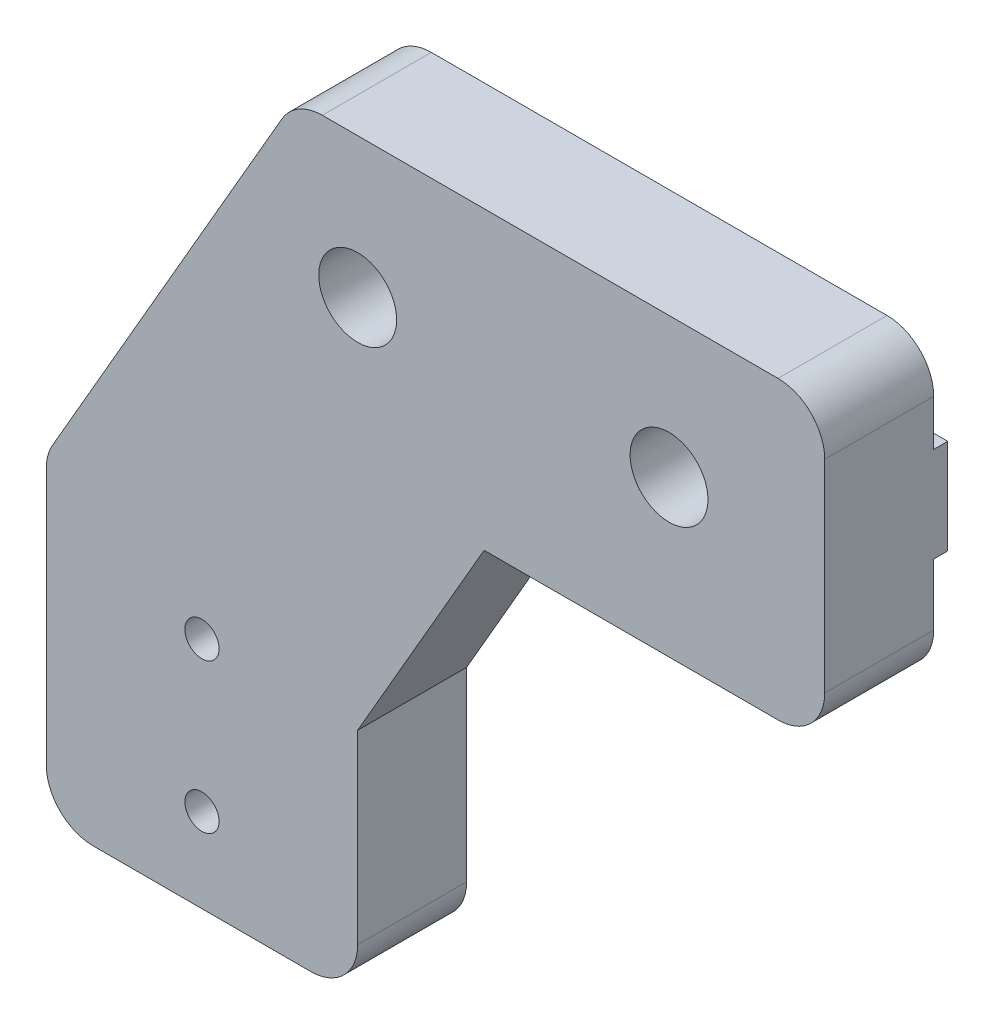
ISO-10303-21;
HEADER;
FILE_DESCRIPTION(('STEP AP214'),'2;1');
FILE_NAME('part.step','',(''),(''),'','','');
FILE_SCHEMA(('AUTOMOTIVE_DESIGN { 1 0 10303 214 1 1 1 1 }'));
ENDSEC;
DATA;
#1=APPLICATION_CONTEXT('core data for automotive mechanical design processes');
#2=APPLICATION_PROTOCOL_DEFINITION('international standard','automotive_design',2000,#1);
#3=PRODUCT_CONTEXT('',#1,'mechanical');
#4=PRODUCT('Part','Part','',(#3));
#5=PRODUCT_RELATED_PRODUCT_CATEGORY('part','',(#4));
#6=PRODUCT_DEFINITION_FORMATION('','',#4);
#7=PRODUCT_DEFINITION_CONTEXT('part definition',#1,'design');
#8=PRODUCT_DEFINITION('design','',#6,#7);
#9=PRODUCT_DEFINITION_SHAPE('','',#8);
#10=(LENGTH_UNIT() NAMED_UNIT(*) SI_UNIT(.MILLI.,.METRE.));
#11=(NAMED_UNIT(*) PLANE_ANGLE_UNIT() SI_UNIT($,.RADIAN.));
#12=(NAMED_UNIT(*) SI_UNIT($,.STERADIAN.) SOLID_ANGLE_UNIT());
#13=UNCERTAINTY_MEASURE_WITH_UNIT(LENGTH_MEASURE(1.E-05),#10,'distance_accuracy_value','');
#14=(GEOMETRIC_REPRESENTATION_CONTEXT(3) GLOBAL_UNCERTAINTY_ASSIGNED_CONTEXT((#13)) GLOBAL_UNIT_ASSIGNED_CONTEXT((#10,
#11,#12)) REPRESENTATION_CONTEXT('',''));
#15=CARTESIAN_POINT('',(0.,0.,0.));
#16=DIRECTION('',(0.,0.,1.));
#17=DIRECTION('',(1.,0.,0.));
#18=AXIS2_PLACEMENT_3D('',#15,#16,#17);
#19=CARTESIAN_POINT('',(3.,19.4833395016044,0.));
#20=DIRECTION('',(0.,0.,-1.));
#21=DIRECTION('',(-1.,0.,0.));
#22=AXIS2_PLACEMENT_3D('',#19,#20,#21);
#23=PLANE('',#22);
#24=CARTESIAN_POINT('',(10.,5.4,0.));
#25=DIRECTION('',(0.,0.,1.));
#26=DIRECTION('',(1.,0.,0.));
#27=AXIS2_PLACEMENT_3D('',#24,#25,#26);
#28=CIRCLE('',#27,1.1);
#29=CARTESIAN_POINT('',(11.1,5.4,0.));
#30=VERTEX_POINT('',#29);
#31=EDGE_CURVE('E197',#30,#30,#28,.T.);
#32=ORIENTED_EDGE('',*,*,#31,.T.);
#33=EDGE_LOOP('',(#32));
#34=FACE_BOUND('',#33,.T.);
#35=CARTESIAN_POINT('',(10.,15.,0.));
#36=DIRECTION('',(0.,0.,1.));
#37=DIRECTION('',(1.,0.,0.));
#38=AXIS2_PLACEMENT_3D('',#35,#36,#37);
#39=CIRCLE('',#38,1.1);
#40=CARTESIAN_POINT('',(11.1,15.,0.));
#41=VERTEX_POINT('',#40);
#42=EDGE_CURVE('E198',#41,#41,#39,.T.);
#43=ORIENTED_EDGE('',*,*,#42,.T.);
#44=EDGE_LOOP('',(#43));
#45=FACE_BOUND('',#44,.T.);
#46=DIRECTION('',(-0.499999999999998,-0.86602540378444,0.));
#47=VECTOR('',#46,1.);
#48=CARTESIAN_POINT('',(15.1339745962156,46.5,0.));
#49=LINE('',#48,#47);
#50=CARTESIAN_POINT('',(9.04292925626505,35.95,0.));
#51=VERTEX_POINT('',#50);
#52=CARTESIAN_POINT('',(0.401923788646674,20.9833395016044,0.));
#53=VERTEX_POINT('',#52);
#54=EDGE_CURVE('E54',#51,#53,#49,.T.);
#55=ORIENTED_EDGE('',*,*,#54,.F.);
#56=DIRECTION('',(1.,0.,0.));
#57=VECTOR('',#56,1.);
#58=CARTESIAN_POINT('',(4.16086702878034,35.95,0.));
#59=LINE('',#58,#57);
#60=CARTESIAN_POINT('',(50.,35.95,0.));
#61=VERTEX_POINT('',#60);
#62=EDGE_CURVE('E49',#51,#61,#59,.T.);
#63=ORIENTED_EDGE('',*,*,#62,.T.);
#64=DIRECTION('',(0.,1.,0.));
#65=VECTOR('',#64,1.);
#66=CARTESIAN_POINT('',(50.,32.,0.));
#67=LINE('',#66,#65);
#68=CARTESIAN_POINT('',(50.,32.,0.));
#69=VERTEX_POINT('',#68);
#70=EDGE_CURVE('E181',#69,#61,#67,.T.);
#71=ORIENTED_EDGE('',*,*,#70,.F.);
#72=CARTESIAN_POINT('',(47.,32.,0.));
#73=DIRECTION('',(0.,0.,1.));
#74=DIRECTION('',(1.,0.,0.));
#75=AXIS2_PLACEMENT_3D('',#72,#73,#74);
#76=CIRCLE('',#75,3.);
#77=CARTESIAN_POINT('',(47.,29.,0.));
#78=VERTEX_POINT('',#77);
#79=EDGE_CURVE('E260',#78,#69,#76,.T.);
#80=ORIENTED_EDGE('',*,*,#79,.F.);
#81=DIRECTION('',(1.,0.,0.));
#82=VECTOR('',#81,1.);
#83=CARTESIAN_POINT('',(28.1243556529822,29.,0.));
#84=LINE('',#83,#82);
#85=CARTESIAN_POINT('',(28.1243556529822,29.,0.));
#86=VERTEX_POINT('',#85);
#87=EDGE_CURVE('E258',#86,#78,#84,.T.);
#88=ORIENTED_EDGE('',*,*,#87,.F.);
#89=DIRECTION('',(0.499999999999998,0.86602540378444,0.));
#90=VECTOR('',#89,1.);
#91=CARTESIAN_POINT('',(20.,14.9282032302754,0.));
#92=LINE('',#91,#90);
#93=CARTESIAN_POINT('',(20.,14.9282032302754,0.));
#94=VERTEX_POINT('',#93);
#95=EDGE_CURVE('E256',#94,#86,#92,.T.);
#96=ORIENTED_EDGE('',*,*,#95,.F.);
#97=DIRECTION('',(0.,1.,0.));
#98=VECTOR('',#97,1.);
#99=CARTESIAN_POINT('',(20.,3.00000000000002,0.));
#100=LINE('',#99,#98);
#101=CARTESIAN_POINT('',(20.,3.00000000000002,0.));
#102=VERTEX_POINT('',#101);
#103=EDGE_CURVE('E254',#102,#94,#100,.T.);
#104=ORIENTED_EDGE('',*,*,#103,.F.);
#105=CARTESIAN_POINT('',(17.,3.,0.));
#106=DIRECTION('',(0.,0.,1.));
#107=DIRECTION('',(1.,0.,0.));
#108=AXIS2_PLACEMENT_3D('',#105,#106,#107);
#109=CIRCLE('',#108,3.);
#110=CARTESIAN_POINT('',(17.,0.,0.));
#111=VERTEX_POINT('',#110);
#112=EDGE_CURVE('E252',#111,#102,#109,.T.);
#113=ORIENTED_EDGE('',*,*,#112,.F.);
#114=DIRECTION('',(1.,0.,0.));
#115=VECTOR('',#114,1.);
#116=CARTESIAN_POINT('',(3.00000000000002,0.,0.));
#117=LINE('',#116,#115);
#118=CARTESIAN_POINT('',(3.00000000000002,0.,0.));
#119=VERTEX_POINT('',#118);
#120=EDGE_CURVE('E250',#119,#111,#117,.T.);
#121=ORIENTED_EDGE('',*,*,#120,.F.);
#122=CARTESIAN_POINT('',(3.,3.,0.));
#123=DIRECTION('',(0.,0.,1.));
#124=DIRECTION('',(1.,0.,0.));
#125=AXIS2_PLACEMENT_3D('',#122,#123,#124);
#126=CIRCLE('',#125,3.);
#127=CARTESIAN_POINT('',(0.,3.00000000000002,0.));
#128=VERTEX_POINT('',#127);
#129=EDGE_CURVE('E248',#128,#119,#126,.T.);
#130=ORIENTED_EDGE('',*,*,#129,.F.);
#131=DIRECTION('',(0.,-1.,0.));
#132=VECTOR('',#131,1.);
#133=CARTESIAN_POINT('',(0.,19.4833395016044,0.));
#134=LINE('',#133,#132);
#135=CARTESIAN_POINT('',(0.,19.4833395016044,0.));
#136=VERTEX_POINT('',#135);
#137=EDGE_CURVE('E246',#136,#128,#134,.T.);
#138=ORIENTED_EDGE('',*,*,#137,.F.);
#139=CARTESIAN_POINT('',(3.,19.4833395016044,0.));
#140=DIRECTION('',(0.,0.,1.));
#141=DIRECTION('',(-1.,0.,0.));
#142=AXIS2_PLACEMENT_3D('',#139,#140,#141);
#143=CIRCLE('',#142,3.);
#144=EDGE_CURVE('E212',#53,#136,#143,.T.);
#145=ORIENTED_EDGE('',*,*,#144,.F.);
#146=EDGE_LOOP('',(#55,#63,#71,#80,#88,#96,#104,#113,#121,#130,#138,#145));
#147=FACE_BOUND('',#146,.T.);
#148=ADVANCED_FACE('F32',(#34,#45,#147),#23,.T.);
#149=CARTESIAN_POINT('',(3.,19.4833395016044,7.));
#150=DIRECTION('',(0.,0.,-1.));
#151=DIRECTION('',(-1.,0.,0.));
#152=AXIS2_PLACEMENT_3D('',#149,#150,#151);
#153=PLANE('',#152);
#154=CARTESIAN_POINT('',(10.,5.4,7.));
#155=DIRECTION('',(0.,0.,1.));
#156=DIRECTION('',(1.,0.,0.));
#157=AXIS2_PLACEMENT_3D('',#154,#155,#156);
#158=CIRCLE('',#157,1.1);
#159=CARTESIAN_POINT('',(11.1,5.4,7.));
#160=VERTEX_POINT('',#159);
#161=EDGE_CURVE('E201',#160,#160,#158,.T.);
#162=ORIENTED_EDGE('',*,*,#161,.F.);
#163=EDGE_LOOP('',(#162));
#164=FACE_BOUND('',#163,.T.);
#165=CARTESIAN_POINT('',(20.,39.,7.));
#166=DIRECTION('',(0.,0.,1.));
#167=DIRECTION('',(1.,0.,0.));
#168=AXIS2_PLACEMENT_3D('',#165,#166,#167);
#169=CIRCLE('',#168,2.5);
#170=CARTESIAN_POINT('',(22.5,39.,7.));
#171=VERTEX_POINT('',#170);
#172=EDGE_CURVE('E209',#171,#171,#169,.T.);
#173=ORIENTED_EDGE('',*,*,#172,.F.);
#174=EDGE_LOOP('',(#173));
#175=FACE_BOUND('',#174,.T.);
#176=CARTESIAN_POINT('',(3.,19.4833395016044,7.));
#177=DIRECTION('',(0.,0.,1.));
#178=DIRECTION('',(-1.,0.,0.));
#179=AXIS2_PLACEMENT_3D('',#176,#177,#178);
#180=CIRCLE('',#179,3.);
#181=CARTESIAN_POINT('',(0.401923788646674,20.9833395016044,7.));
#182=VERTEX_POINT('',#181);
#183=CARTESIAN_POINT('',(0.,19.4833395016044,7.));
#184=VERTEX_POINT('',#183);
#185=EDGE_CURVE('E213',#182,#184,#180,.T.);
#186=ORIENTED_EDGE('',*,*,#185,.T.);
#187=DIRECTION('',(0.,-1.,0.));
#188=VECTOR('',#187,1.);
#189=CARTESIAN_POINT('',(0.,19.4833395016044,7.));
#190=LINE('',#189,#188);
#191=CARTESIAN_POINT('',(0.,3.00000000000002,7.));
#192=VERTEX_POINT('',#191);
#193=EDGE_CURVE('E216',#184,#192,#190,.T.);
#194=ORIENTED_EDGE('',*,*,#193,.T.);
#195=CARTESIAN_POINT('',(3.,3.,7.));
#196=DIRECTION('',(0.,0.,1.));
#197=DIRECTION('',(1.,0.,0.));
#198=AXIS2_PLACEMENT_3D('',#195,#196,#197);
#199=CIRCLE('',#198,3.);
#200=CARTESIAN_POINT('',(3.00000000000002,0.,7.));
#201=VERTEX_POINT('',#200);
#202=EDGE_CURVE('E219',#192,#201,#199,.T.);
#203=ORIENTED_EDGE('',*,*,#202,.T.);
#204=DIRECTION('',(1.,0.,0.));
#205=VECTOR('',#204,1.);
#206=CARTESIAN_POINT('',(3.00000000000002,0.,7.));
#207=LINE('',#206,#205);
#208=CARTESIAN_POINT('',(17.,0.,7.));
#209=VERTEX_POINT('',#208);
#210=EDGE_CURVE('E221',#201,#209,#207,.T.);
#211=ORIENTED_EDGE('',*,*,#210,.T.);
#212=CARTESIAN_POINT('',(17.,3.,7.));
#213=DIRECTION('',(0.,0.,1.));
#214=DIRECTION('',(1.,0.,0.));
#215=AXIS2_PLACEMENT_3D('',#212,#213,#214);
#216=CIRCLE('',#215,3.);
#217=CARTESIAN_POINT('',(20.,3.00000000000002,7.));
#218=VERTEX_POINT('',#217);
#219=EDGE_CURVE('E223',#209,#218,#216,.T.);
#220=ORIENTED_EDGE('',*,*,#219,.T.);
#221=DIRECTION('',(0.,1.,0.));
#222=VECTOR('',#221,1.);
#223=CARTESIAN_POINT('',(20.,3.00000000000002,7.));
#224=LINE('',#223,#222);
#225=CARTESIAN_POINT('',(20.,14.9282032302754,7.));
#226=VERTEX_POINT('',#225);
#227=EDGE_CURVE('E225',#218,#226,#224,.T.);
#228=ORIENTED_EDGE('',*,*,#227,.T.);
#229=DIRECTION('',(0.499999999999998,0.86602540378444,0.));
#230=VECTOR('',#229,1.);
#231=CARTESIAN_POINT('',(20.,14.9282032302754,7.));
#232=LINE('',#231,#230);
#233=CARTESIAN_POINT('',(28.1243556529822,29.,7.));
#234=VERTEX_POINT('',#233);
#235=EDGE_CURVE('E227',#226,#234,#232,.T.);
#236=ORIENTED_EDGE('',*,*,#235,.T.);
#237=DIRECTION('',(1.,0.,0.));
#238=VECTOR('',#237,1.);
#239=CARTESIAN_POINT('',(28.1243556529822,29.,7.));
#240=LINE('',#239,#238);
#241=CARTESIAN_POINT('',(47.,29.,7.));
#242=VERTEX_POINT('',#241);
#243=EDGE_CURVE('E229',#234,#242,#240,.T.);
#244=ORIENTED_EDGE('',*,*,#243,.T.);
#245=CARTESIAN_POINT('',(47.,32.,7.));
#246=DIRECTION('',(0.,0.,1.));
#247=DIRECTION('',(1.,0.,0.));
#248=AXIS2_PLACEMENT_3D('',#245,#246,#247);
#249=CIRCLE('',#248,3.);
#250=CARTESIAN_POINT('',(50.,32.,7.));
#251=VERTEX_POINT('',#250);
#252=EDGE_CURVE('E231',#242,#251,#249,.T.);
#253=ORIENTED_EDGE('',*,*,#252,.T.);
#254=DIRECTION('',(0.,1.,0.));
#255=VECTOR('',#254,1.);
#256=CARTESIAN_POINT('',(50.,32.,7.));
#257=LINE('',#256,#255);
#258=CARTESIAN_POINT('',(50.,45.,7.));
#259=VERTEX_POINT('',#258);
#260=EDGE_CURVE('E233',#251,#259,#257,.T.);
#261=ORIENTED_EDGE('',*,*,#260,.T.);
#262=CARTESIAN_POINT('',(47.,45.,7.));
#263=DIRECTION('',(0.,0.,1.));
#264=DIRECTION('',(1.,0.,0.));
#265=AXIS2_PLACEMENT_3D('',#262,#263,#264);
#266=CIRCLE('',#265,3.);
#267=CARTESIAN_POINT('',(47.,48.,7.));
#268=VERTEX_POINT('',#267);
#269=EDGE_CURVE('E235',#259,#268,#266,.T.);
#270=ORIENTED_EDGE('',*,*,#269,.T.);
#271=DIRECTION('',(-1.,0.,0.));
#272=VECTOR('',#271,1.);
#273=CARTESIAN_POINT('',(47.,48.,7.));
#274=LINE('',#273,#272);
#275=CARTESIAN_POINT('',(17.7320508075689,48.,7.));
#276=VERTEX_POINT('',#275);
#277=EDGE_CURVE('E237',#268,#276,#274,.T.);
#278=ORIENTED_EDGE('',*,*,#277,.T.);
#279=CARTESIAN_POINT('',(17.7320508075689,45.,7.));
#280=DIRECTION('',(0.,0.,1.));
#281=DIRECTION('',(-1.,0.,0.));
#282=AXIS2_PLACEMENT_3D('',#279,#280,#281);
#283=CIRCLE('',#282,3.);
#284=CARTESIAN_POINT('',(15.1339745962156,46.5,7.));
#285=VERTEX_POINT('',#284);
#286=EDGE_CURVE('E239',#276,#285,#283,.T.);
#287=ORIENTED_EDGE('',*,*,#286,.T.);
#288=DIRECTION('',(-0.499999999999998,-0.86602540378444,0.));
#289=VECTOR('',#288,1.);
#290=CARTESIAN_POINT('',(15.1339745962156,46.5,7.));
#291=LINE('',#290,#289);
#292=EDGE_CURVE('E241',#285,#182,#291,.T.);
#293=ORIENTED_EDGE('',*,*,#292,.T.);
#294=EDGE_LOOP('',(#186,#194,#203,#211,#220,#228,#236,#244,#253,#261,#270,#278,#287,#293));
#295=FACE_BOUND('',#294,.T.);
#296=CARTESIAN_POINT('',(40.,39.,7.));
#297=DIRECTION('',(0.,0.,1.));
#298=DIRECTION('',(1.,0.,0.));
#299=AXIS2_PLACEMENT_3D('',#296,#297,#298);
#300=CIRCLE('',#299,2.5);
#301=CARTESIAN_POINT('',(42.5,39.,7.));
#302=VERTEX_POINT('',#301);
#303=EDGE_CURVE('E204',#302,#302,#300,.T.);
#304=ORIENTED_EDGE('',*,*,#303,.F.);
#305=EDGE_LOOP('',(#304));
#306=FACE_BOUND('',#305,.T.);
#307=CARTESIAN_POINT('',(10.,15.,7.));
#308=DIRECTION('',(0.,0.,1.));
#309=DIRECTION('',(1.,0.,0.));
#310=AXIS2_PLACEMENT_3D('',#307,#308,#309);
#311=CIRCLE('',#310,1.1);
#312=CARTESIAN_POINT('',(11.1,15.,7.));
#313=VERTEX_POINT('',#312);
#314=EDGE_CURVE('E194',#313,#313,#311,.T.);
#315=ORIENTED_EDGE('',*,*,#314,.F.);
#316=EDGE_LOOP('',(#315));
#317=FACE_BOUND('',#316,.T.);
#318=ADVANCED_FACE('F334',(#164,#175,#295,#306,#317),#153,.F.);
#319=DIRECTION('',(1.,0.,0.));
#320=VECTOR('',#319,1.);
#321=CARTESIAN_POINT('',(4.16086702878034,42.05,0.));
#322=LINE('',#321,#320);
#323=CARTESIAN_POINT('',(12.5647658983217,42.05,0.));
#324=VERTEX_POINT('',#323);
#325=CARTESIAN_POINT('',(50.,42.05,0.));
#326=VERTEX_POINT('',#325);
#327=EDGE_CURVE('E355',#324,#326,#322,.T.);
#328=ORIENTED_EDGE('',*,*,#327,.F.);
#329=CARTESIAN_POINT('',(15.1339745962156,46.5,0.));
#330=VERTEX_POINT('',#329);
#331=EDGE_CURVE('E217',#330,#324,#49,.T.);
#332=ORIENTED_EDGE('',*,*,#331,.F.);
#333=CARTESIAN_POINT('',(17.7320508075689,45.,0.));
#334=DIRECTION('',(0.,0.,1.));
#335=DIRECTION('',(-1.,0.,0.));
#336=AXIS2_PLACEMENT_3D('',#333,#334,#335);
#337=CIRCLE('',#336,3.);
#338=CARTESIAN_POINT('',(17.7320508075689,48.,0.));
#339=VERTEX_POINT('',#338);
#340=EDGE_CURVE('E274',#339,#330,#337,.T.);
#341=ORIENTED_EDGE('',*,*,#340,.F.);
#342=DIRECTION('',(-1.,0.,0.));
#343=VECTOR('',#342,1.);
#344=CARTESIAN_POINT('',(47.,48.,0.));
#345=LINE('',#344,#343);
#346=CARTESIAN_POINT('',(47.,48.,0.));
#347=VERTEX_POINT('',#346);
#348=EDGE_CURVE('E412',#347,#339,#345,.T.);
#349=ORIENTED_EDGE('',*,*,#348,.F.);
#350=CARTESIAN_POINT('',(47.,45.,0.));
#351=DIRECTION('',(0.,0.,1.));
#352=DIRECTION('',(1.,0.,0.));
#353=AXIS2_PLACEMENT_3D('',#350,#351,#352);
#354=CIRCLE('',#353,3.);
#355=CARTESIAN_POINT('',(50.,45.,0.));
#356=VERTEX_POINT('',#355);
#357=EDGE_CURVE('E265',#356,#347,#354,.T.);
#358=ORIENTED_EDGE('',*,*,#357,.F.);
#359=EDGE_CURVE('E262',#326,#356,#67,.T.);
#360=ORIENTED_EDGE('',*,*,#359,.F.);
#361=EDGE_LOOP('',(#328,#332,#341,#349,#358,#360));
#362=FACE_BOUND('',#361,.T.);
#363=ADVANCED_FACE('F389',(#362),#23,.T.);
#364=CARTESIAN_POINT('',(3.,19.4833395016044,7.));
#365=DIRECTION('',(0.,0.,-1.));
#366=DIRECTION('',(-1.,0.,0.));
#367=AXIS2_PLACEMENT_3D('',#364,#365,#366);
#368=CYLINDRICAL_SURFACE('',#367,3.);
#369=ORIENTED_EDGE('',*,*,#144,.T.);
#370=DIRECTION('',(0.,0.,-1.));
#371=VECTOR('',#370,1.);
#372=CARTESIAN_POINT('',(0.,19.4833395016044,7.));
#373=LINE('',#372,#371);
#374=EDGE_CURVE('E11',#184,#136,#373,.T.);
#375=ORIENTED_EDGE('',*,*,#374,.F.);
#376=ORIENTED_EDGE('',*,*,#185,.F.);
#377=DIRECTION('',(0.,0.,-1.));
#378=VECTOR('',#377,1.);
#379=CARTESIAN_POINT('',(0.401923788646674,20.9833395016044,7.));
#380=LINE('',#379,#378);
#381=EDGE_CURVE('E243',#182,#53,#380,.T.);
#382=ORIENTED_EDGE('',*,*,#381,.T.);
#383=EDGE_LOOP('',(#369,#375,#376,#382));
#384=FACE_BOUND('',#383,.T.);
#385=ADVANCED_FACE('F34',(#384),#368,.T.);
#386=CARTESIAN_POINT('',(0.,19.4833395016044,7.));
#387=DIRECTION('',(1.,0.,0.));
#388=DIRECTION('',(0.,0.,-1.));
#389=AXIS2_PLACEMENT_3D('',#386,#387,#388);
#390=PLANE('',#389);
#391=ORIENTED_EDGE('',*,*,#137,.T.);
#392=DIRECTION('',(0.,0.,-1.));
#393=VECTOR('',#392,1.);
#394=CARTESIAN_POINT('',(0.,3.00000000000002,7.));
#395=LINE('',#394,#393);
#396=EDGE_CURVE('E41',#192,#128,#395,.T.);
#397=ORIENTED_EDGE('',*,*,#396,.F.);
#398=ORIENTED_EDGE('',*,*,#193,.F.);
#399=ORIENTED_EDGE('',*,*,#374,.T.);
#400=EDGE_LOOP('',(#391,#397,#398,#399));
#401=FACE_BOUND('',#400,.T.);
#402=ADVANCED_FACE('F339',(#401),#390,.F.);
#403=CARTESIAN_POINT('',(3.,3.,7.));
#404=DIRECTION('',(0.,0.,-1.));
#405=DIRECTION('',(-1.,0.,0.));
#406=AXIS2_PLACEMENT_3D('',#403,#404,#405);
#407=CYLINDRICAL_SURFACE('',#406,3.);
#408=ORIENTED_EDGE('',*,*,#129,.T.);
#409=DIRECTION('',(0.,0.,-1.));
#410=VECTOR('',#409,1.);
#411=CARTESIAN_POINT('',(3.00000000000002,0.,7.));
#412=LINE('',#411,#410);
#413=EDGE_CURVE('E310',#201,#119,#412,.T.);
#414=ORIENTED_EDGE('',*,*,#413,.F.);
#415=ORIENTED_EDGE('',*,*,#202,.F.);
#416=ORIENTED_EDGE('',*,*,#396,.T.);
#417=EDGE_LOOP('',(#408,#414,#415,#416));
#418=FACE_BOUND('',#417,.T.);
#419=ADVANCED_FACE('F318',(#418),#407,.T.);
#420=CARTESIAN_POINT('',(3.00000000000002,0.,7.));
#421=DIRECTION('',(0.,1.,0.));
#422=DIRECTION('',(0.,0.,1.));
#423=AXIS2_PLACEMENT_3D('',#420,#421,#422);
#424=PLANE('',#423);
#425=ORIENTED_EDGE('',*,*,#120,.T.);
#426=DIRECTION('',(0.,0.,-1.));
#427=VECTOR('',#426,1.);
#428=CARTESIAN_POINT('',(17.,0.,7.));
#429=LINE('',#428,#427);
#430=EDGE_CURVE('E307',#209,#111,#429,.T.);
#431=ORIENTED_EDGE('',*,*,#430,.F.);
#432=ORIENTED_EDGE('',*,*,#210,.F.);
#433=ORIENTED_EDGE('',*,*,#413,.T.);
#434=EDGE_LOOP('',(#425,#431,#432,#433));
#435=FACE_BOUND('',#434,.T.);
#436=ADVANCED_FACE('F326',(#435),#424,.F.);
#437=CARTESIAN_POINT('',(17.,3.,7.));
#438=DIRECTION('',(0.,0.,-1.));
#439=DIRECTION('',(-1.,0.,0.));
#440=AXIS2_PLACEMENT_3D('',#437,#438,#439);
#441=CYLINDRICAL_SURFACE('',#440,3.);
#442=ORIENTED_EDGE('',*,*,#112,.T.);
#443=DIRECTION('',(0.,0.,-1.));
#444=VECTOR('',#443,1.);
#445=CARTESIAN_POINT('',(20.,3.00000000000002,7.));
#446=LINE('',#445,#444);
#447=EDGE_CURVE('E304',#218,#102,#446,.T.);
#448=ORIENTED_EDGE('',*,*,#447,.F.);
#449=ORIENTED_EDGE('',*,*,#219,.F.);
#450=ORIENTED_EDGE('',*,*,#430,.T.);
#451=EDGE_LOOP('',(#442,#448,#449,#450));
#452=FACE_BOUND('',#451,.T.);
#453=ADVANCED_FACE('F330',(#452),#441,.T.);
#454=CARTESIAN_POINT('',(20.,3.00000000000002,7.));
#455=DIRECTION('',(-1.,0.,0.));
#456=DIRECTION('',(0.,0.,1.));
#457=AXIS2_PLACEMENT_3D('',#454,#455,#456);
#458=PLANE('',#457);
#459=ORIENTED_EDGE('',*,*,#103,.T.);
#460=DIRECTION('',(0.,0.,-1.));
#461=VECTOR('',#460,1.);
#462=CARTESIAN_POINT('',(20.,14.9282032302754,7.));
#463=LINE('',#462,#461);
#464=EDGE_CURVE('E301',#226,#94,#463,.T.);
#465=ORIENTED_EDGE('',*,*,#464,.F.);
#466=ORIENTED_EDGE('',*,*,#227,.F.);
#467=ORIENTED_EDGE('',*,*,#447,.T.);
#468=EDGE_LOOP('',(#459,#465,#466,#467));
#469=FACE_BOUND('',#468,.T.);
#470=ADVANCED_FACE('F435',(#469),#458,.F.);
#471=CARTESIAN_POINT('',(20.,14.9282032302754,7.));
#472=DIRECTION('',(-0.86602540378444,0.499999999999998,0.));
#473=DIRECTION('',(-0.499999999999998,-0.86602540378444,0.));
#474=AXIS2_PLACEMENT_3D('',#471,#472,#473);
#475=PLANE('',#474);
#476=ORIENTED_EDGE('',*,*,#95,.T.);
#477=DIRECTION('',(0.,0.,-1.));
#478=VECTOR('',#477,1.);
#479=CARTESIAN_POINT('',(28.1243556529822,29.,7.));
#480=LINE('',#479,#478);
#481=EDGE_CURVE('E298',#234,#86,#480,.T.);
#482=ORIENTED_EDGE('',*,*,#481,.F.);
#483=ORIENTED_EDGE('',*,*,#235,.F.);
#484=ORIENTED_EDGE('',*,*,#464,.T.);
#485=EDGE_LOOP('',(#476,#482,#483,#484));
#486=FACE_BOUND('',#485,.T.);
#487=ADVANCED_FACE('F433',(#486),#475,.F.);
#488=CARTESIAN_POINT('',(28.1243556529822,29.,7.));
#489=DIRECTION('',(0.,1.,0.));
#490=DIRECTION('',(-1.,0.,0.));
#491=AXIS2_PLACEMENT_3D('',#488,#489,#490);
#492=PLANE('',#491);
#493=ORIENTED_EDGE('',*,*,#87,.T.);
#494=DIRECTION('',(0.,0.,-1.));
#495=VECTOR('',#494,1.);
#496=CARTESIAN_POINT('',(47.,29.,7.));
#497=LINE('',#496,#495);
#498=EDGE_CURVE('E295',#242,#78,#497,.T.);
#499=ORIENTED_EDGE('',*,*,#498,.F.);
#500=ORIENTED_EDGE('',*,*,#243,.F.);
#501=ORIENTED_EDGE('',*,*,#481,.T.);
#502=EDGE_LOOP('',(#493,#499,#500,#501));
#503=FACE_BOUND('',#502,.T.);
#504=ADVANCED_FACE('F429',(#503),#492,.F.);
#505=CARTESIAN_POINT('',(47.,32.,7.));
#506=DIRECTION('',(0.,0.,-1.));
#507=DIRECTION('',(-1.,0.,0.));
#508=AXIS2_PLACEMENT_3D('',#505,#506,#507);
#509=CYLINDRICAL_SURFACE('',#508,3.);
#510=ORIENTED_EDGE('',*,*,#79,.T.);
#511=DIRECTION('',(0.,0.,-1.));
#512=VECTOR('',#511,1.);
#513=CARTESIAN_POINT('',(50.,32.,7.));
#514=LINE('',#513,#512);
#515=EDGE_CURVE('E293',#251,#69,#514,.T.);
#516=ORIENTED_EDGE('',*,*,#515,.F.);
#517=ORIENTED_EDGE('',*,*,#252,.F.);
#518=ORIENTED_EDGE('',*,*,#498,.T.);
#519=EDGE_LOOP('',(#510,#516,#517,#518));
#520=FACE_BOUND('',#519,.T.);
#521=ADVANCED_FACE('F425',(#520),#509,.T.);
#522=CARTESIAN_POINT('',(50.,32.,7.));
#523=DIRECTION('',(-1.,0.,0.));
#524=DIRECTION('',(0.,0.,1.));
#525=AXIS2_PLACEMENT_3D('',#522,#523,#524);
#526=PLANE('',#525);
#527=ORIENTED_EDGE('',*,*,#70,.T.);
#528=DIRECTION('',(0.,0.,-1.));
#529=VECTOR('',#528,1.);
#530=CARTESIAN_POINT('',(50.,35.95,0.));
#531=LINE('',#530,#529);
#532=CARTESIAN_POINT('',(50.,35.95,-0.900000000000001));
#533=VERTEX_POINT('',#532);
#534=EDGE_CURVE('E164',#61,#533,#531,.T.);
#535=ORIENTED_EDGE('',*,*,#534,.T.);
#536=DIRECTION('',(0.,-1.,0.));
#537=VECTOR('',#536,1.);
#538=CARTESIAN_POINT('',(50.,42.05,-0.9));
#539=LINE('',#538,#537);
#540=CARTESIAN_POINT('',(50.,42.05,-0.9));
#541=VERTEX_POINT('',#540);
#542=EDGE_CURVE('E171',#541,#533,#539,.T.);
#543=ORIENTED_EDGE('',*,*,#542,.F.);
#544=DIRECTION('',(0.,0.,-1.));
#545=VECTOR('',#544,1.);
#546=CARTESIAN_POINT('',(50.,42.05,0.));
#547=LINE('',#546,#545);
#548=EDGE_CURVE('E177',#326,#541,#547,.T.);
#549=ORIENTED_EDGE('',*,*,#548,.F.);
#550=ORIENTED_EDGE('',*,*,#359,.T.);
#551=DIRECTION('',(0.,0.,-1.));
#552=VECTOR('',#551,1.);
#553=CARTESIAN_POINT('',(50.,45.,7.));
#554=LINE('',#553,#552);
#555=EDGE_CURVE('E290',#259,#356,#554,.T.);
#556=ORIENTED_EDGE('',*,*,#555,.F.);
#557=ORIENTED_EDGE('',*,*,#260,.F.);
#558=ORIENTED_EDGE('',*,*,#515,.T.);
#559=EDGE_LOOP('',(#527,#535,#543,#549,#550,#556,#557,#558));
#560=FACE_BOUND('',#559,.T.);
#561=ADVANCED_FACE('F179',(#560),#526,.F.);
#562=CARTESIAN_POINT('',(47.,45.,7.));
#563=DIRECTION('',(0.,0.,-1.));
#564=DIRECTION('',(-1.,0.,0.));
#565=AXIS2_PLACEMENT_3D('',#562,#563,#564);
#566=CYLINDRICAL_SURFACE('',#565,3.);
#567=ORIENTED_EDGE('',*,*,#357,.T.);
#568=DIRECTION('',(0.,0.,-1.));
#569=VECTOR('',#568,1.);
#570=CARTESIAN_POINT('',(47.,48.,7.));
#571=LINE('',#570,#569);
#572=EDGE_CURVE('E287',#268,#347,#571,.T.);
#573=ORIENTED_EDGE('',*,*,#572,.F.);
#574=ORIENTED_EDGE('',*,*,#269,.F.);
#575=ORIENTED_EDGE('',*,*,#555,.T.);
#576=EDGE_LOOP('',(#567,#573,#574,#575));
#577=FACE_BOUND('',#576,.T.);
#578=ADVANCED_FACE('F409',(#577),#566,.T.);
#579=CARTESIAN_POINT('',(47.,48.,7.));
#580=DIRECTION('',(0.,-1.,0.));
#581=DIRECTION('',(1.,0.,0.));
#582=AXIS2_PLACEMENT_3D('',#579,#580,#581);
#583=PLANE('',#582);
#584=ORIENTED_EDGE('',*,*,#348,.T.);
#585=DIRECTION('',(0.,0.,-1.));
#586=VECTOR('',#585,1.);
#587=CARTESIAN_POINT('',(17.7320508075689,48.,7.));
#588=LINE('',#587,#586);
#589=EDGE_CURVE('E284',#276,#339,#588,.T.);
#590=ORIENTED_EDGE('',*,*,#589,.F.);
#591=ORIENTED_EDGE('',*,*,#277,.F.);
#592=ORIENTED_EDGE('',*,*,#572,.T.);
#593=EDGE_LOOP('',(#584,#590,#591,#592));
#594=FACE_BOUND('',#593,.T.);
#595=ADVANCED_FACE('F418',(#594),#583,.F.);
#596=CARTESIAN_POINT('',(17.7320508075689,45.,7.));
#597=DIRECTION('',(0.,0.,-1.));
#598=DIRECTION('',(-1.,0.,0.));
#599=AXIS2_PLACEMENT_3D('',#596,#597,#598);
#600=CYLINDRICAL_SURFACE('',#599,3.);
#601=ORIENTED_EDGE('',*,*,#340,.T.);
#602=DIRECTION('',(0.,0.,-1.));
#603=VECTOR('',#602,1.);
#604=CARTESIAN_POINT('',(15.1339745962156,46.5,7.));
#605=LINE('',#604,#603);
#606=EDGE_CURVE('E281',#285,#330,#605,.T.);
#607=ORIENTED_EDGE('',*,*,#606,.F.);
#608=ORIENTED_EDGE('',*,*,#286,.F.);
#609=ORIENTED_EDGE('',*,*,#589,.T.);
#610=EDGE_LOOP('',(#601,#607,#608,#609));
#611=FACE_BOUND('',#610,.T.);
#612=ADVANCED_FACE('F383',(#611),#600,.T.);
#613=CARTESIAN_POINT('',(15.1339745962156,46.5,7.));
#614=DIRECTION('',(0.86602540378444,-0.499999999999998,0.));
#615=DIRECTION('',(0.499999999999998,0.86602540378444,0.));
#616=AXIS2_PLACEMENT_3D('',#613,#614,#615);
#617=PLANE('',#616);
#618=ORIENTED_EDGE('',*,*,#331,.T.);
#619=DIRECTION('',(0.,0.,1.));
#620=VECTOR('',#619,1.);
#621=CARTESIAN_POINT('',(12.5647658983217,42.05,0.));
#622=LINE('',#621,#620);
#623=CARTESIAN_POINT('',(12.5647658983217,42.05,-0.9));
#624=VERTEX_POINT('',#623);
#625=EDGE_CURVE('E347',#624,#324,#622,.T.);
#626=ORIENTED_EDGE('',*,*,#625,.F.);
#627=DIRECTION('',(0.499999999999998,0.86602540378444,0.));
#628=VECTOR('',#627,1.);
#629=CARTESIAN_POINT('',(10.4637911809364,38.4110050440709,-0.9));
#630=LINE('',#629,#628);
#631=CARTESIAN_POINT('',(9.04292925626505,35.95,-0.900000000000001));
#632=VERTEX_POINT('',#631);
#633=EDGE_CURVE('E346',#632,#624,#630,.T.);
#634=ORIENTED_EDGE('',*,*,#633,.F.);
#635=DIRECTION('',(0.,0.,1.));
#636=VECTOR('',#635,1.);
#637=CARTESIAN_POINT('',(9.04292925626505,35.95,0.));
#638=LINE('',#637,#636);
#639=EDGE_CURVE('E165',#632,#51,#638,.T.);
#640=ORIENTED_EDGE('',*,*,#639,.T.);
#641=ORIENTED_EDGE('',*,*,#54,.T.);
#642=ORIENTED_EDGE('',*,*,#381,.F.);
#643=ORIENTED_EDGE('',*,*,#292,.F.);
#644=ORIENTED_EDGE('',*,*,#606,.T.);
#645=EDGE_LOOP('',(#618,#626,#634,#640,#641,#642,#643,#644));
#646=FACE_BOUND('',#645,.T.);
#647=ADVANCED_FACE('F345',(#646),#617,.F.);
#648=CARTESIAN_POINT('',(20.,39.,7.));
#649=DIRECTION('',(0.,0.,-1.));
#650=DIRECTION('',(-1.,0.,0.));
#651=AXIS2_PLACEMENT_3D('',#648,#649,#650);
#652=CYLINDRICAL_SURFACE('',#651,2.5);
#653=ORIENTED_EDGE('',*,*,#172,.T.);
#654=EDGE_LOOP('',(#653));
#655=FACE_BOUND('',#654,.T.);
#656=CARTESIAN_POINT('',(20.,39.,-0.9));
#657=DIRECTION('',(0.,0.,1.));
#658=DIRECTION('',(0.,-1.,0.));
#659=AXIS2_PLACEMENT_3D('',#656,#657,#658);
#660=CIRCLE('',#659,2.5);
#661=CARTESIAN_POINT('',(20.,36.5,-0.900000000000001));
#662=VERTEX_POINT('',#661);
#663=EDGE_CURVE('E182',#662,#662,#660,.F.);
#664=ORIENTED_EDGE('',*,*,#663,.T.);
#665=EDGE_LOOP('',(#664));
#666=FACE_BOUND('',#665,.T.);
#667=ADVANCED_FACE('F372',(#655,#666),#652,.F.);
#668=CARTESIAN_POINT('',(40.,39.,7.));
#669=DIRECTION('',(0.,0.,-1.));
#670=DIRECTION('',(-1.,0.,0.));
#671=AXIS2_PLACEMENT_3D('',#668,#669,#670);
#672=CYLINDRICAL_SURFACE('',#671,2.5);
#673=ORIENTED_EDGE('',*,*,#303,.T.);
#674=EDGE_LOOP('',(#673));
#675=FACE_BOUND('',#674,.T.);
#676=CARTESIAN_POINT('',(40.,39.,-0.9));
#677=DIRECTION('',(0.,0.,1.));
#678=DIRECTION('',(0.,-1.,0.));
#679=AXIS2_PLACEMENT_3D('',#676,#677,#678);
#680=CIRCLE('',#679,2.5);
#681=CARTESIAN_POINT('',(40.,36.5,-0.900000000000001));
#682=VERTEX_POINT('',#681);
#683=EDGE_CURVE('E184',#682,#682,#680,.F.);
#684=ORIENTED_EDGE('',*,*,#683,.T.);
#685=EDGE_LOOP('',(#684));
#686=FACE_BOUND('',#685,.T.);
#687=ADVANCED_FACE('F364',(#675,#686),#672,.F.);
#688=CARTESIAN_POINT('',(10.,5.4,7.));
#689=DIRECTION('',(0.,0.,-1.));
#690=DIRECTION('',(-1.,0.,0.));
#691=AXIS2_PLACEMENT_3D('',#688,#689,#690);
#692=CYLINDRICAL_SURFACE('',#691,1.1);
#693=ORIENTED_EDGE('',*,*,#161,.T.);
#694=EDGE_LOOP('',(#693));
#695=FACE_BOUND('',#694,.T.);
#696=ORIENTED_EDGE('',*,*,#31,.F.);
#697=EDGE_LOOP('',(#696));
#698=FACE_BOUND('',#697,.T.);
#699=ADVANCED_FACE('F380',(#695,#698),#692,.F.);
#700=CARTESIAN_POINT('',(10.,15.,7.));
#701=DIRECTION('',(0.,0.,-1.));
#702=DIRECTION('',(-1.,0.,0.));
#703=AXIS2_PLACEMENT_3D('',#700,#701,#702);
#704=CYLINDRICAL_SURFACE('',#703,1.1);
#705=ORIENTED_EDGE('',*,*,#314,.T.);
#706=EDGE_LOOP('',(#705));
#707=FACE_BOUND('',#706,.T.);
#708=ORIENTED_EDGE('',*,*,#42,.F.);
#709=EDGE_LOOP('',(#708));
#710=FACE_BOUND('',#709,.T.);
#711=ADVANCED_FACE('F527',(#707,#710),#704,.F.);
#712=CARTESIAN_POINT('',(4.16086702878034,35.95,0.));
#713=DIRECTION('',(0.,-1.,0.));
#714=DIRECTION('',(0.,0.,-1.));
#715=AXIS2_PLACEMENT_3D('',#712,#713,#714);
#716=PLANE('',#715);
#717=ORIENTED_EDGE('',*,*,#639,.F.);
#718=DIRECTION('',(1.,0.,0.));
#719=VECTOR('',#718,1.);
#720=CARTESIAN_POINT('',(4.16086702878034,35.95,-0.900000000000001));
#721=LINE('',#720,#719);
#722=EDGE_CURVE('E160',#632,#533,#721,.T.);
#723=ORIENTED_EDGE('',*,*,#722,.T.);
#724=ORIENTED_EDGE('',*,*,#534,.F.);
#725=ORIENTED_EDGE('',*,*,#62,.F.);
#726=EDGE_LOOP('',(#717,#723,#724,#725));
#727=FACE_BOUND('',#726,.T.);
#728=ADVANCED_FACE('F162',(#727),#716,.T.);
#729=CARTESIAN_POINT('',(4.16086702878034,42.05,-0.9));
#730=DIRECTION('',(0.,0.,1.));
#731=DIRECTION('',(0.,-1.,0.));
#732=AXIS2_PLACEMENT_3D('',#729,#730,#731);
#733=PLANE('',#732);
#734=ORIENTED_EDGE('',*,*,#683,.F.);
#735=EDGE_LOOP('',(#734));
#736=FACE_BOUND('',#735,.T.);
#737=ORIENTED_EDGE('',*,*,#663,.F.);
#738=EDGE_LOOP('',(#737));
#739=FACE_BOUND('',#738,.T.);
#740=ORIENTED_EDGE('',*,*,#722,.F.);
#741=ORIENTED_EDGE('',*,*,#633,.T.);
#742=DIRECTION('',(1.,0.,0.));
#743=VECTOR('',#742,1.);
#744=CARTESIAN_POINT('',(4.16086702878034,42.05,-0.9));
#745=LINE('',#744,#743);
#746=EDGE_CURVE('E168',#624,#541,#745,.T.);
#747=ORIENTED_EDGE('',*,*,#746,.T.);
#748=ORIENTED_EDGE('',*,*,#542,.T.);
#749=EDGE_LOOP('',(#740,#741,#747,#748));
#750=FACE_BOUND('',#749,.T.);
#751=ADVANCED_FACE('F172',(#736,#739,#750),#733,.F.);
#752=CARTESIAN_POINT('',(4.16086702878034,42.05,0.));
#753=DIRECTION('',(0.,-1.,0.));
#754=DIRECTION('',(0.,0.,-1.));
#755=AXIS2_PLACEMENT_3D('',#752,#753,#754);
#756=PLANE('',#755);
#757=ORIENTED_EDGE('',*,*,#746,.F.);
#758=ORIENTED_EDGE('',*,*,#625,.T.);
#759=ORIENTED_EDGE('',*,*,#327,.T.);
#760=ORIENTED_EDGE('',*,*,#548,.T.);
#761=EDGE_LOOP('',(#757,#758,#759,#760));
#762=FACE_BOUND('',#761,.T.);
#763=ADVANCED_FACE('F368',(#762),#756,.F.);
#764=CLOSED_SHELL('',(#148,#318,#363,#385,#402,#419,#436,#453,#470,#487,#504,#521,#561,#578,
#595,#612,#647,#667,#687,#699,#711,#728,#751,#763));
#765=MANIFOLD_SOLID_BREP('B2',#764);
#766=ADVANCED_BREP_SHAPE_REPRESENTATION('',(#18,#765),#14);
#767=SHAPE_DEFINITION_REPRESENTATION(#9,#766);
ENDSEC;
END-ISO-10303-21;
